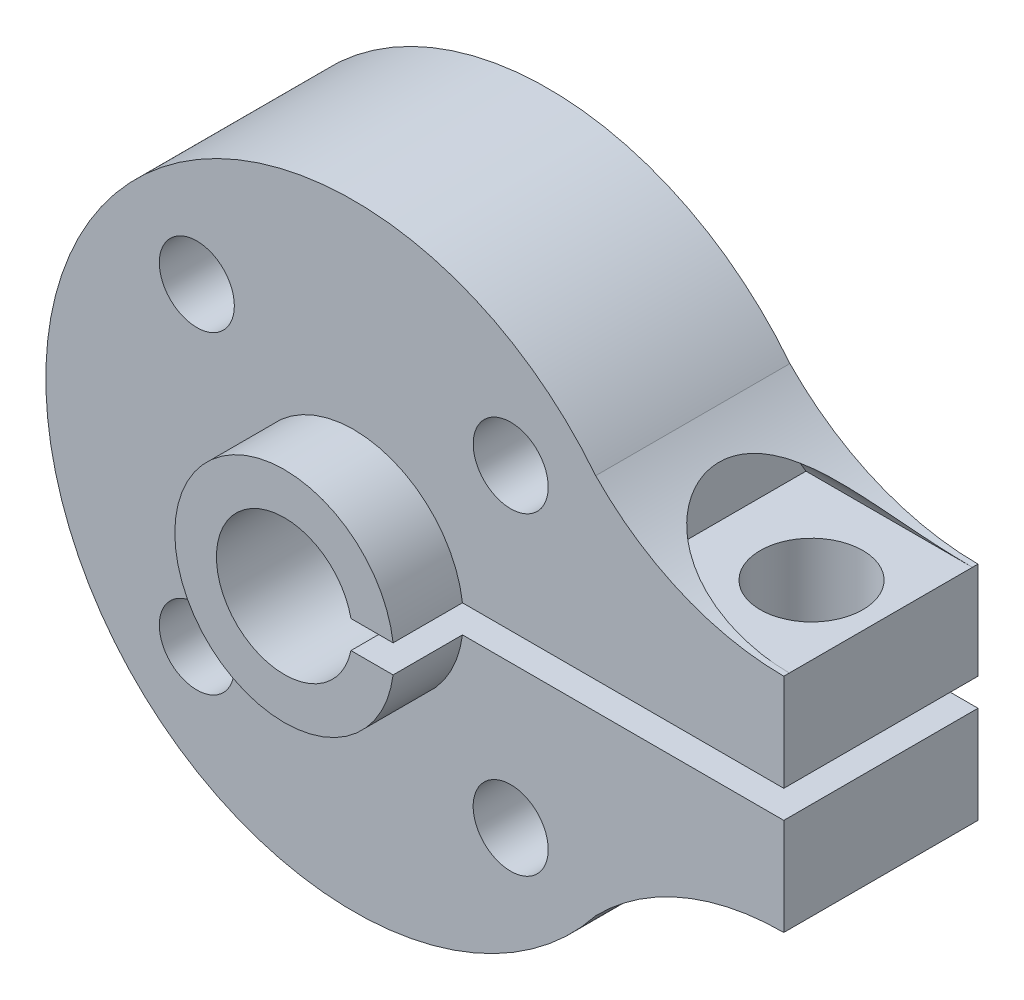
ISO-10303-21;
HEADER;
FILE_DESCRIPTION(('STEP AP214'),'2;1');
FILE_NAME('part.step','',(''),(''),'','','');
FILE_SCHEMA(('AUTOMOTIVE_DESIGN { 1 0 10303 214 1 1 1 1 }'));
ENDSEC;
DATA;
#1=APPLICATION_CONTEXT('core data for automotive mechanical design processes');
#2=APPLICATION_PROTOCOL_DEFINITION('international standard','automotive_design',2000,#1);
#3=PRODUCT_CONTEXT('',#1,'mechanical');
#4=PRODUCT('Part','Part','',(#3));
#5=PRODUCT_RELATED_PRODUCT_CATEGORY('part','',(#4));
#6=PRODUCT_DEFINITION_FORMATION('','',#4);
#7=PRODUCT_DEFINITION_CONTEXT('part definition',#1,'design');
#8=PRODUCT_DEFINITION('design','',#6,#7);
#9=PRODUCT_DEFINITION_SHAPE('','',#8);
#10=(LENGTH_UNIT() NAMED_UNIT(*) SI_UNIT(.MILLI.,.METRE.));
#11=(NAMED_UNIT(*) PLANE_ANGLE_UNIT() SI_UNIT($,.RADIAN.));
#12=(NAMED_UNIT(*) SI_UNIT($,.STERADIAN.) SOLID_ANGLE_UNIT());
#13=UNCERTAINTY_MEASURE_WITH_UNIT(LENGTH_MEASURE(1.E-05),#10,'distance_accuracy_value','');
#14=(GEOMETRIC_REPRESENTATION_CONTEXT(3) GLOBAL_UNCERTAINTY_ASSIGNED_CONTEXT((#13)) GLOBAL_UNIT_ASSIGNED_CONTEXT((#10,
#11,#12)) REPRESENTATION_CONTEXT('',''));
#15=CARTESIAN_POINT('',(0.,0.,0.));
#16=DIRECTION('',(0.,0.,1.));
#17=DIRECTION('',(1.,0.,0.));
#18=AXIS2_PLACEMENT_3D('',#15,#16,#17);
#19=CARTESIAN_POINT('',(9.5,2.30819429931814,-3.5));
#20=DIRECTION('',(-1.,0.,0.));
#21=DIRECTION('',(0.,0.,1.));
#22=AXIS2_PLACEMENT_3D('',#19,#20,#21);
#23=PLANE('',#22);
#24=DIRECTION('',(0.,0.,-1.));
#25=VECTOR('',#24,1.);
#26=CARTESIAN_POINT('',(9.5,4.,-0.2));
#27=LINE('',#26,#25);
#28=CARTESIAN_POINT('',(9.5,4.,-0.199999999999997));
#29=VERTEX_POINT('',#28);
#30=CARTESIAN_POINT('',(9.5,4.,-6.8));
#31=VERTEX_POINT('',#30);
#32=EDGE_CURVE('E128',#29,#31,#27,.T.);
#33=ORIENTED_EDGE('',*,*,#32,.T.);
#34=CARTESIAN_POINT('',(9.5,2.30819429931814,-3.5));
#35=DIRECTION('',(1.,0.,0.));
#36=DIRECTION('',(0.,0.,-1.));
#37=AXIS2_PLACEMENT_3D('',#34,#35,#36);
#38=CIRCLE('',#37,3.70839675990308);
#39=EDGE_CURVE('E275',#31,#29,#38,.T.);
#40=ORIENTED_EDGE('',*,*,#39,.T.);
#41=EDGE_LOOP('',(#33,#40));
#42=FACE_BOUND('',#41,.T.);
#43=ADVANCED_FACE('F18',(#42),#23,.F.);
#44=CARTESIAN_POINT('',(9.5,4.,-0.2));
#45=DIRECTION('',(0.,-1.,0.));
#46=DIRECTION('',(0.,0.,-1.));
#47=AXIS2_PLACEMENT_3D('',#44,#45,#46);
#48=PLANE('',#47);
#49=CARTESIAN_POINT('',(13.,4.,-3.5));
#50=DIRECTION('',(0.,-1.,0.));
#51=DIRECTION('',(0.,0.,-1.));
#52=AXIS2_PLACEMENT_3D('',#49,#50,#51);
#53=CIRCLE('',#52,1.85);
#54=CARTESIAN_POINT('',(13.,4.,-5.35));
#55=VERTEX_POINT('',#54);
#56=EDGE_CURVE('E21',#55,#55,#53,.T.);
#57=ORIENTED_EDGE('',*,*,#56,.T.);
#58=EDGE_LOOP('',(#57));
#59=FACE_BOUND('',#58,.T.);
#60=DIRECTION('',(1.,0.,0.));
#61=VECTOR('',#60,1.);
#62=CARTESIAN_POINT('',(9.5,4.,-6.8));
#63=LINE('',#62,#61);
#64=CARTESIAN_POINT('',(15.5,4.00000000000001,-6.8));
#65=VERTEX_POINT('',#64);
#66=EDGE_CURVE('E103',#65,#31,#63,.F.);
#67=ORIENTED_EDGE('',*,*,#66,.T.);
#68=ORIENTED_EDGE('',*,*,#32,.F.);
#69=DIRECTION('',(1.,0.,0.));
#70=VECTOR('',#69,1.);
#71=CARTESIAN_POINT('',(9.5,4.,-0.199999999999997));
#72=LINE('',#71,#70);
#73=CARTESIAN_POINT('',(15.5,4.00000000000001,-0.199999999999999));
#74=VERTEX_POINT('',#73);
#75=EDGE_CURVE('E122',#29,#74,#72,.T.);
#76=ORIENTED_EDGE('',*,*,#75,.T.);
#77=DIRECTION('',(0.,0.,-1.));
#78=VECTOR('',#77,1.);
#79=CARTESIAN_POINT('',(15.5,4.,-7.));
#80=LINE('',#79,#78);
#81=EDGE_CURVE('E119',#65,#74,#80,.F.);
#82=ORIENTED_EDGE('',*,*,#81,.F.);
#83=EDGE_LOOP('',(#67,#68,#76,#82));
#84=FACE_BOUND('',#83,.T.);
#85=ADVANCED_FACE('F195',(#59,#84),#48,.F.);
#86=CARTESIAN_POINT('',(0.,0.,2.5));
#87=DIRECTION('',(0.,0.,1.));
#88=DIRECTION('',(1.,0.,0.));
#89=AXIS2_PLACEMENT_3D('',#86,#87,#88);
#90=PLANE('',#89);
#91=CARTESIAN_POINT('',(0.,0.,2.5));
#92=DIRECTION('',(0.,0.,-1.));
#93=DIRECTION('',(-1.,0.,0.));
#94=AXIS2_PLACEMENT_3D('',#91,#92,#93);
#95=CIRCLE('',#94,3.95);
#96=CARTESIAN_POINT('',(3.91822663969301,-0.5,2.5));
#97=VERTEX_POINT('',#96);
#98=CARTESIAN_POINT('',(3.91822663969301,0.5,2.5));
#99=VERTEX_POINT('',#98);
#100=EDGE_CURVE('E93',#97,#99,#95,.T.);
#101=ORIENTED_EDGE('',*,*,#100,.F.);
#102=DIRECTION('',(1.,0.,0.));
#103=VECTOR('',#102,1.);
#104=CARTESIAN_POINT('',(0.,-0.5,2.5));
#105=LINE('',#104,#103);
#106=CARTESIAN_POINT('',(2.39843699104229,-0.500000000000001,2.5));
#107=VERTEX_POINT('',#106);
#108=EDGE_CURVE('E98',#107,#97,#105,.T.);
#109=ORIENTED_EDGE('',*,*,#108,.F.);
#110=CARTESIAN_POINT('',(0.,0.,2.5));
#111=DIRECTION('',(0.,0.,1.));
#112=DIRECTION('',(1.,0.,0.));
#113=AXIS2_PLACEMENT_3D('',#110,#111,#112);
#114=CIRCLE('',#113,2.45);
#115=CARTESIAN_POINT('',(2.39843699104229,0.5,2.5));
#116=VERTEX_POINT('',#115);
#117=EDGE_CURVE('E112',#107,#116,#114,.F.);
#118=ORIENTED_EDGE('',*,*,#117,.T.);
#119=DIRECTION('',(1.,0.,0.));
#120=VECTOR('',#119,1.);
#121=CARTESIAN_POINT('',(0.,0.5,2.5));
#122=LINE('',#121,#120);
#123=EDGE_CURVE('E100',#116,#99,#122,.T.);
#124=ORIENTED_EDGE('',*,*,#123,.T.);
#125=EDGE_LOOP('',(#101,#109,#118,#124));
#126=FACE_BOUND('',#125,.T.);
#127=ADVANCED_FACE('F95',(#126),#90,.T.);
#128=CARTESIAN_POINT('',(13.,11.1,-3.5));
#129=DIRECTION('',(0.,-1.,0.));
#130=DIRECTION('',(0.,0.,-1.));
#131=AXIS2_PLACEMENT_3D('',#128,#129,#130);
#132=CYLINDRICAL_SURFACE('',#131,1.85);
#133=CARTESIAN_POINT('',(13.,0.5,-3.5));
#134=DIRECTION('',(0.,-1.,0.));
#135=DIRECTION('',(0.,0.,-1.));
#136=AXIS2_PLACEMENT_3D('',#133,#134,#135);
#137=CIRCLE('',#136,1.85);
#138=CARTESIAN_POINT('',(13.,0.5,-5.35));
#139=VERTEX_POINT('',#138);
#140=EDGE_CURVE('E271',#139,#139,#137,.F.);
#141=ORIENTED_EDGE('',*,*,#140,.F.);
#142=EDGE_LOOP('',(#141));
#143=FACE_BOUND('',#142,.T.);
#144=ORIENTED_EDGE('',*,*,#56,.F.);
#145=EDGE_LOOP('',(#144));
#146=FACE_BOUND('',#145,.T.);
#147=ADVANCED_FACE('F190',(#143,#146),#132,.F.);
#148=CARTESIAN_POINT('',(0.,0.,2.5));
#149=DIRECTION('',(0.,0.,-1.));
#150=DIRECTION('',(-1.,0.,0.));
#151=AXIS2_PLACEMENT_3D('',#148,#149,#150);
#152=CYLINDRICAL_SURFACE('',#151,3.95);
#153=CARTESIAN_POINT('',(0.,0.,0.));
#154=DIRECTION('',(0.,0.,-1.));
#155=DIRECTION('',(-1.,0.,0.));
#156=AXIS2_PLACEMENT_3D('',#153,#154,#155);
#157=CIRCLE('',#156,3.95);
#158=CARTESIAN_POINT('',(3.91822663969301,-0.5,0.));
#159=VERTEX_POINT('',#158);
#160=CARTESIAN_POINT('',(3.91822663969301,0.5,0.));
#161=VERTEX_POINT('',#160);
#162=EDGE_CURVE('E108',#159,#161,#157,.T.);
#163=ORIENTED_EDGE('',*,*,#162,.F.);
#164=DIRECTION('',(0.,0.,1.));
#165=VECTOR('',#164,1.);
#166=CARTESIAN_POINT('',(3.91822663969301,-0.5,-7.));
#167=LINE('',#166,#165);
#168=EDGE_CURVE('E105',#97,#159,#167,.F.);
#169=ORIENTED_EDGE('',*,*,#168,.F.);
#170=ORIENTED_EDGE('',*,*,#100,.T.);
#171=DIRECTION('',(0.,0.,-1.));
#172=VECTOR('',#171,1.);
#173=CARTESIAN_POINT('',(3.91822663969301,0.5,-7.));
#174=LINE('',#173,#172);
#175=EDGE_CURVE('E126',#161,#99,#174,.F.);
#176=ORIENTED_EDGE('',*,*,#175,.F.);
#177=EDGE_LOOP('',(#163,#169,#170,#176));
#178=FACE_BOUND('',#177,.T.);
#179=ADVANCED_FACE('F106',(#178),#152,.T.);
#180=CARTESIAN_POINT('',(9.5,2.30819429931814,-3.5));
#181=DIRECTION('',(1.,0.,0.));
#182=DIRECTION('',(0.,0.,-1.));
#183=AXIS2_PLACEMENT_3D('',#180,#181,#182);
#184=CYLINDRICAL_SURFACE('',#183,3.70839675990308);
#185=ORIENTED_EDGE('',*,*,#75,.F.);
#186=ORIENTED_EDGE('',*,*,#39,.F.);
#187=ORIENTED_EDGE('',*,*,#66,.F.);
#188=CARTESIAN_POINT('',(15.5,4.00000000000001,-6.8));
#189=CARTESIAN_POINT('',(15.3854172561424,3.99999807144268,-6.79999040357477));
#190=CARTESIAN_POINT('',(15.2708345037204,4.00208452565124,-6.79893104370746));
#191=CARTESIAN_POINT('',(15.0418545088414,4.01042007363529,-6.79464326988381));
#192=CARTESIAN_POINT('',(14.927457277829,4.01666941510604,-6.79141472685915));
#193=CARTESIAN_POINT('',(14.6988557808845,4.03333058412203,-6.78271174393225));
#194=CARTESIAN_POINT('',(14.5846521614541,4.04374938302888,-6.7772335421817));
#195=CARTESIAN_POINT('',(14.3568466591295,4.06871528645662,-6.76388854983141));
#196=CARTESIAN_POINT('',(14.2432447653972,4.08326231636213,-6.75602180240309));
#197=CARTESIAN_POINT('',(13.9012476272513,4.13338726905937,-6.72837211210196));
#198=CARTESIAN_POINT('',(13.6740472792935,4.17527511633217,-6.70462249151998));
#199=CARTESIAN_POINT('',(13.2250868669362,4.27510326310531,-6.6443418692978));
#200=CARTESIAN_POINT('',(13.0033221022707,4.33302911979295,-6.60782235966463));
#201=CARTESIAN_POINT('',(12.6529356022981,4.43813091397702,-6.53609331014185));
#202=CARTESIAN_POINT('',(12.5218503492442,4.48063203510912,-6.50597227338733));
#203=CARTESIAN_POINT('',(12.2632290057728,4.57071030493076,-6.43877426680966));
#204=CARTESIAN_POINT('',(12.1356928962284,4.61828742625828,-6.40169733448122));
#205=CARTESIAN_POINT('',(11.8854487831583,4.71775519771825,-6.31963922664295));
#206=CARTESIAN_POINT('',(11.7627254940675,4.76963022726073,-6.27468606548902));
#207=CARTESIAN_POINT('',(11.5227135874723,4.87697578128224,-6.1756110759212));
#208=CARTESIAN_POINT('',(11.4054232772453,4.9324451727882,-6.12149212804412));
#209=CARTESIAN_POINT('',(11.1256985684173,5.071639846092,-5.97585734382104));
#210=CARTESIAN_POINT('',(10.9669053561282,5.15677415238714,-5.87851068639103));
#211=CARTESIAN_POINT('',(10.6682954041506,5.32718244619846,-5.65805983866076));
#212=CARTESIAN_POINT('',(10.5284532138079,5.41245608755684,-5.53499076935316));
#213=CARTESIAN_POINT('',(10.3029570714845,5.55700216381974,-5.29236628463612));
#214=CARTESIAN_POINT('',(10.2122236670459,5.61776209979495,-5.17843958840173));
#215=CARTESIAN_POINT('',(10.0487893069114,5.73065496290753,-4.93421505548655));
#216=CARTESIAN_POINT('',(9.9760826861075,5.78279059860417,-4.80392238142989));
#217=CARTESIAN_POINT('',(9.88271984953563,5.85123562170812,-4.59746178007879));
#218=CARTESIAN_POINT('',(9.85411340712692,5.87250463892868,-4.52642625450106));
#219=CARTESIAN_POINT('',(9.8026542883283,5.91113202664649,-4.38128999145579));
#220=CARTESIAN_POINT('',(9.77979860146108,5.92849244276425,-4.30719088150623));
#221=CARTESIAN_POINT('',(9.74015073098037,5.95881984828704,-4.15653545136116));
#222=CARTESIAN_POINT('',(9.72335620443467,5.97178853518842,-4.07998009311206));
#223=CARTESIAN_POINT('',(9.69604787686337,5.99297113329586,-3.92514115874213));
#224=CARTESIAN_POINT('',(9.68553304823361,6.00118582243504,-3.84685786755397));
#225=CARTESIAN_POINT('',(9.66571269419053,6.01668686364119,-3.63272797682053));
#226=CARTESIAN_POINT('',(9.66268060711464,6.01908388455584,-3.49585578487429));
#227=CARTESIAN_POINT('',(9.67580092483512,6.00879517138107,-3.22372435833211));
#228=CARTESIAN_POINT('',(9.69194697787807,5.99611443100813,-3.08846460468292));
#229=CARTESIAN_POINT('',(9.74140060570358,5.95784036040203,-2.83033541035476));
#230=CARTESIAN_POINT('',(9.77379479620415,5.93293564756356,-2.70718559216987));
#231=CARTESIAN_POINT('',(9.85403038461301,5.87246966733323,-2.46884489684084));
#232=CARTESIAN_POINT('',(9.90187372262157,5.83690706156605,-2.3536550215112));
#233=CARTESIAN_POINT('',(10.0153708669368,5.75467131035559,-2.12530832541396));
#234=CARTESIAN_POINT('',(10.0820564209863,5.70738398145104,-2.01289063057051));
#235=CARTESIAN_POINT('',(10.2292221810183,5.6064316192375,-1.80068540326612));
#236=CARTESIAN_POINT('',(10.3097094543092,5.5527633228289,-1.7009043872791));
#237=CARTESIAN_POINT('',(10.4617575283369,5.45514545743436,-1.53638994983406));
#238=CARTESIAN_POINT('',(10.5309064551307,5.41191057285586,-1.46895760039825));
#239=CARTESIAN_POINT('',(10.6750840937526,5.32452300554102,-1.34130785397804));
#240=CARTESIAN_POINT('',(10.7501152592551,5.28036994550685,-1.28109349462555));
#241=CARTESIAN_POINT('',(10.9053325302043,5.19204954805675,-1.16745307872577));
#242=CARTESIAN_POINT('',(10.9855265073713,5.14788229613573,-1.11403777634629));
#243=CARTESIAN_POINT('',(11.1502648300482,5.06037063385561,-1.01360351201137));
#244=CARTESIAN_POINT('',(11.2348105538086,5.01702649020899,-0.966586593895368));
#245=CARTESIAN_POINT('',(11.4491601443267,4.911317642686,-0.857234031716228));
#246=CARTESIAN_POINT('',(11.5811855099708,4.84982407399195,-0.798397249946977));
#247=CARTESIAN_POINT('',(11.8517008005558,4.73158833415568,-0.691850969184468));
#248=CARTESIAN_POINT('',(11.9901938582407,4.6748485035395,-0.644146931053226));
#249=CARTESIAN_POINT('',(12.2727994055429,4.56698866176262,-0.55809041968488));
#250=CARTESIAN_POINT('',(12.4169310013095,4.51589049754443,-0.519773645044782));
#251=CARTESIAN_POINT('',(12.7092115298442,4.4202921877755,-0.451279086548751));
#252=CARTESIAN_POINT('',(12.8573601583134,4.37579154409097,-0.421100688078474));
#253=CARTESIAN_POINT('',(13.2088503671494,4.27964035910126,-0.358348077632845));
#254=CARTESIAN_POINT('',(13.4134887431049,4.2308754157276,-0.328582781999699));
#255=CARTESIAN_POINT('',(13.8267983828837,4.14695137700669,-0.279202513194161));
#256=CARTESIAN_POINT('',(14.0354716910433,4.11179937907043,-0.259592833084839));
#257=CARTESIAN_POINT('',(14.4530137871775,4.05585754801038,-0.229084764078337));
#258=CARTESIAN_POINT('',(14.6618549020662,4.03491321046651,-0.218092452133776));
#259=CARTESIAN_POINT('',(14.9758505914231,4.0139678532927,-0.207190475715985));
#260=CARTESIAN_POINT('',(15.0805924216449,4.00873126349008,-0.20448752831259));
#261=CARTESIAN_POINT('',(15.2902194458754,4.00174728093229,-0.200895003143423));
#262=CARTESIAN_POINT('',(15.3951046341522,3.99999975253346,-0.200005354882309));
#263=CARTESIAN_POINT('',(15.5,4.00000000000001,-0.200000000000002));
#264=B_SPLINE_CURVE_WITH_KNOTS('',3,(#188,#189,#190,#191,#192,#193,#194,#195,#196,#197,#198,
#199,#200,#201,#202,#203,#204,#205,#206,#207,#208,#209,#210,#211,#212,#213,#214,#215,#216,#217,
#218,#219,#220,#221,#222,#223,#224,#225,#226,#227,#228,#229,#230,#231,#232,#233,#234,#235,#236,
#237,#238,#239,#240,#241,#242,#243,#244,#245,#246,#247,#248,#249,#250,#251,#252,#253,#254,#255,
#256,#257,#258,#259,#260,#261,#262,#263),.UNSPECIFIED.,.F.,.F.,(4,2,2,2,2,2,2,2,2,2,2,2,2,2,2,2,
2,2,2,2,2,2,2,2,2,2,2,2,2,2,2,2,2,2,2,2,2,4),(0.,0.343723971843537,0.687468397378402,
1.03178998346891,1.37610534654196,2.07189509147165,2.76706027899653,3.18996821448662,
3.61287387042043,4.03430477997363,4.45560349113384,5.06790502421624,5.67937592856169,
6.15105760704356,6.62259086613704,6.86072027072558,7.09872475577783,7.33663714177353,
7.57451058532365,7.9829511201066,8.391256418087,8.77882172170533,9.16643571462257,
9.58186622266927,9.99751009479543,10.3145531519377,10.6317291690792,10.9494007936139,
11.2671736551728,11.7376814003852,12.2084194574227,12.6809208132693,13.1533864755719,
13.7899635271709,14.4268720269306,15.0567382504914,15.3713976456646,15.6860448076409),.UNSPECIFIED.);
#265=EDGE_CURVE('E166',#65,#74,#264,.T.);
#266=ORIENTED_EDGE('',*,*,#265,.T.);
#267=EDGE_LOOP('',(#185,#186,#187,#266));
#268=FACE_BOUND('',#267,.T.);
#269=ADVANCED_FACE('F180',(#268),#184,.F.);
#270=CARTESIAN_POINT('',(15.5,0.5,-7.));
#271=DIRECTION('',(1.,0.,0.));
#272=DIRECTION('',(0.,0.,-1.));
#273=AXIS2_PLACEMENT_3D('',#270,#271,#272);
#274=PLANE('',#273);
#275=ORIENTED_EDGE('',*,*,#81,.T.);
#276=DIRECTION('',(0.,0.,1.));
#277=VECTOR('',#276,1.);
#278=CARTESIAN_POINT('',(15.5,4.00000000000001,-7.));
#279=LINE('',#278,#277);
#280=CARTESIAN_POINT('',(15.5,4.00000000000001,0.));
#281=VERTEX_POINT('',#280);
#282=EDGE_CURVE('E231',#74,#281,#279,.T.);
#283=ORIENTED_EDGE('',*,*,#282,.T.);
#284=DIRECTION('',(0.,1.,0.));
#285=VECTOR('',#284,1.);
#286=CARTESIAN_POINT('',(15.5,-13.4475790200994,0.));
#287=LINE('',#286,#285);
#288=CARTESIAN_POINT('',(15.5,0.5,0.));
#289=VERTEX_POINT('',#288);
#290=EDGE_CURVE('E242',#289,#281,#287,.T.);
#291=ORIENTED_EDGE('',*,*,#290,.F.);
#292=DIRECTION('',(0.,0.,-1.));
#293=VECTOR('',#292,1.);
#294=CARTESIAN_POINT('',(15.5,0.5,-7.));
#295=LINE('',#294,#293);
#296=CARTESIAN_POINT('',(15.5,0.5,-7.));
#297=VERTEX_POINT('',#296);
#298=EDGE_CURVE('E261',#297,#289,#295,.F.);
#299=ORIENTED_EDGE('',*,*,#298,.F.);
#300=DIRECTION('',(0.,1.,0.));
#301=VECTOR('',#300,1.);
#302=CARTESIAN_POINT('',(15.5,-13.4475790200994,-7.));
#303=LINE('',#302,#301);
#304=CARTESIAN_POINT('',(15.5,4.00000000000001,-7.));
#305=VERTEX_POINT('',#304);
#306=EDGE_CURVE('E174',#297,#305,#303,.T.);
#307=ORIENTED_EDGE('',*,*,#306,.T.);
#308=DIRECTION('',(0.,0.,1.));
#309=VECTOR('',#308,1.);
#310=CARTESIAN_POINT('',(15.5,4.00000000000001,-7.));
#311=LINE('',#310,#309);
#312=EDGE_CURVE('E175',#305,#65,#311,.T.);
#313=ORIENTED_EDGE('',*,*,#312,.T.);
#314=EDGE_LOOP('',(#275,#283,#291,#299,#307,#313));
#315=FACE_BOUND('',#314,.T.);
#316=ADVANCED_FACE('F185',(#315),#274,.T.);
#317=CARTESIAN_POINT('',(0.,-0.5,-7.));
#318=DIRECTION('',(0.,1.,0.));
#319=DIRECTION('',(0.,0.,1.));
#320=AXIS2_PLACEMENT_3D('',#317,#318,#319);
#321=PLANE('',#320);
#322=CARTESIAN_POINT('',(13.,-0.5,-3.5));
#323=DIRECTION('',(0.,1.,0.));
#324=DIRECTION('',(0.,0.,1.));
#325=AXIS2_PLACEMENT_3D('',#322,#323,#324);
#326=CIRCLE('',#325,1.35254999999999);
#327=CARTESIAN_POINT('',(13.,-0.5,-2.14745000000001));
#328=VERTEX_POINT('',#327);
#329=EDGE_CURVE('E270',#328,#328,#326,.F.);
#330=ORIENTED_EDGE('',*,*,#329,.T.);
#331=EDGE_LOOP('',(#330));
#332=FACE_BOUND('',#331,.T.);
#333=DIRECTION('',(0.,0.,-1.));
#334=VECTOR('',#333,1.);
#335=CARTESIAN_POINT('',(15.5,-0.5,-7.));
#336=LINE('',#335,#334);
#337=CARTESIAN_POINT('',(15.5,-0.5,-7.));
#338=VERTEX_POINT('',#337);
#339=CARTESIAN_POINT('',(15.5,-0.5,0.));
#340=VERTEX_POINT('',#339);
#341=EDGE_CURVE('E267',#338,#340,#336,.F.);
#342=ORIENTED_EDGE('',*,*,#341,.F.);
#343=DIRECTION('',(1.,0.,0.));
#344=VECTOR('',#343,1.);
#345=CARTESIAN_POINT('',(15.5,-0.5,-7.));
#346=LINE('',#345,#344);
#347=CARTESIAN_POINT('',(2.39843699104229,-0.500000000000001,-7.));
#348=VERTEX_POINT('',#347);
#349=EDGE_CURVE('E218',#338,#348,#346,.F.);
#350=ORIENTED_EDGE('',*,*,#349,.T.);
#351=DIRECTION('',(0.,0.,1.));
#352=VECTOR('',#351,1.);
#353=CARTESIAN_POINT('',(2.39843699104229,-0.500000000000002,-7.));
#354=LINE('',#353,#352);
#355=EDGE_CURVE('E117',#348,#107,#354,.T.);
#356=ORIENTED_EDGE('',*,*,#355,.T.);
#357=ORIENTED_EDGE('',*,*,#108,.T.);
#358=ORIENTED_EDGE('',*,*,#168,.T.);
#359=DIRECTION('',(1.,0.,0.));
#360=VECTOR('',#359,1.);
#361=CARTESIAN_POINT('',(15.5,-0.5,0.));
#362=LINE('',#361,#360);
#363=EDGE_CURVE('E234',#340,#159,#362,.F.);
#364=ORIENTED_EDGE('',*,*,#363,.F.);
#365=EDGE_LOOP('',(#342,#350,#356,#357,#358,#364));
#366=FACE_BOUND('',#365,.T.);
#367=ADVANCED_FACE('F115',(#332,#366),#321,.T.);
#368=CARTESIAN_POINT('',(0.,0.,-7.));
#369=DIRECTION('',(0.,0.,1.));
#370=DIRECTION('',(1.,0.,0.));
#371=AXIS2_PLACEMENT_3D('',#368,#369,#370);
#372=CYLINDRICAL_SURFACE('',#371,2.45);
#373=CARTESIAN_POINT('',(0.,0.,-7.));
#374=DIRECTION('',(0.,0.,1.));
#375=DIRECTION('',(1.,0.,0.));
#376=AXIS2_PLACEMENT_3D('',#373,#374,#375);
#377=CIRCLE('',#376,2.45);
#378=CARTESIAN_POINT('',(2.39843699104229,0.5,-7.));
#379=VERTEX_POINT('',#378);
#380=EDGE_CURVE('E319',#348,#379,#377,.F.);
#381=ORIENTED_EDGE('',*,*,#380,.T.);
#382=DIRECTION('',(0.,0.,-1.));
#383=VECTOR('',#382,1.);
#384=CARTESIAN_POINT('',(2.39843699104229,0.5,-7.));
#385=LINE('',#384,#383);
#386=EDGE_CURVE('E258',#116,#379,#385,.T.);
#387=ORIENTED_EDGE('',*,*,#386,.F.);
#388=ORIENTED_EDGE('',*,*,#117,.F.);
#389=ORIENTED_EDGE('',*,*,#355,.F.);
#390=EDGE_LOOP('',(#381,#387,#388,#389));
#391=FACE_BOUND('',#390,.T.);
#392=ADVANCED_FACE('F330',(#391),#372,.F.);
#393=CARTESIAN_POINT('',(0.,0.5,-7.));
#394=DIRECTION('',(0.,-1.,0.));
#395=DIRECTION('',(0.,0.,-1.));
#396=AXIS2_PLACEMENT_3D('',#393,#394,#395);
#397=PLANE('',#396);
#398=ORIENTED_EDGE('',*,*,#140,.T.);
#399=EDGE_LOOP('',(#398));
#400=FACE_BOUND('',#399,.T.);
#401=ORIENTED_EDGE('',*,*,#175,.T.);
#402=ORIENTED_EDGE('',*,*,#123,.F.);
#403=ORIENTED_EDGE('',*,*,#386,.T.);
#404=DIRECTION('',(1.,0.,0.));
#405=VECTOR('',#404,1.);
#406=CARTESIAN_POINT('',(15.5,0.5,-7.));
#407=LINE('',#406,#405);
#408=EDGE_CURVE('E318',#379,#297,#407,.T.);
#409=ORIENTED_EDGE('',*,*,#408,.T.);
#410=ORIENTED_EDGE('',*,*,#298,.T.);
#411=DIRECTION('',(1.,0.,0.));
#412=VECTOR('',#411,1.);
#413=CARTESIAN_POINT('',(15.5,0.5,0.));
#414=LINE('',#413,#412);
#415=EDGE_CURVE('E247',#161,#289,#414,.T.);
#416=ORIENTED_EDGE('',*,*,#415,.F.);
#417=EDGE_LOOP('',(#401,#402,#403,#409,#410,#416));
#418=FACE_BOUND('',#417,.T.);
#419=ADVANCED_FACE('F332',(#400,#418),#397,.T.);
#420=CARTESIAN_POINT('',(-5.65651622481619,5.65719225397115,0.));
#421=DIRECTION('',(0.,0.,1.));
#422=DIRECTION('',(1.,0.,0.));
#423=AXIS2_PLACEMENT_3D('',#420,#421,#422);
#424=CYLINDRICAL_SURFACE('',#423,1.35254999999999);
#425=CARTESIAN_POINT('',(-5.65651622481619,5.65719225397115,0.));
#426=DIRECTION('',(0.,0.,1.));
#427=DIRECTION('',(1.,0.,0.));
#428=AXIS2_PLACEMENT_3D('',#425,#426,#427);
#429=CIRCLE('',#428,1.35254999999999);
#430=CARTESIAN_POINT('',(-4.3039662248162,5.65719225397115,0.));
#431=VERTEX_POINT('',#430);
#432=EDGE_CURVE('E236',#431,#431,#429,.F.);
#433=ORIENTED_EDGE('',*,*,#432,.F.);
#434=EDGE_LOOP('',(#433));
#435=FACE_BOUND('',#434,.T.);
#436=CARTESIAN_POINT('',(-5.65651622481619,5.65719225397115,-7.));
#437=DIRECTION('',(0.,0.,1.));
#438=DIRECTION('',(1.,0.,0.));
#439=AXIS2_PLACEMENT_3D('',#436,#437,#438);
#440=CIRCLE('',#439,1.35254999999999);
#441=CARTESIAN_POINT('',(-4.3039662248162,5.65719225397115,-7.));
#442=VERTEX_POINT('',#441);
#443=EDGE_CURVE('E316',#442,#442,#440,.F.);
#444=ORIENTED_EDGE('',*,*,#443,.T.);
#445=EDGE_LOOP('',(#444));
#446=FACE_BOUND('',#445,.T.);
#447=ADVANCED_FACE('F364',(#435,#446),#424,.F.);
#448=CARTESIAN_POINT('',(5.65719225397115,5.65651622481619,0.));
#449=DIRECTION('',(0.,0.,1.));
#450=DIRECTION('',(1.,0.,0.));
#451=AXIS2_PLACEMENT_3D('',#448,#449,#450);
#452=CYLINDRICAL_SURFACE('',#451,1.35254999999999);
#453=CARTESIAN_POINT('',(5.65719225397115,5.65651622481619,0.));
#454=DIRECTION('',(0.,0.,1.));
#455=DIRECTION('',(1.,0.,0.));
#456=AXIS2_PLACEMENT_3D('',#453,#454,#455);
#457=CIRCLE('',#456,1.35254999999999);
#458=CARTESIAN_POINT('',(7.00974225397114,5.65651622481619,0.));
#459=VERTEX_POINT('',#458);
#460=EDGE_CURVE('E290',#459,#459,#457,.F.);
#461=ORIENTED_EDGE('',*,*,#460,.F.);
#462=EDGE_LOOP('',(#461));
#463=FACE_BOUND('',#462,.T.);
#464=CARTESIAN_POINT('',(5.65719225397115,5.65651622481619,-7.));
#465=DIRECTION('',(0.,0.,1.));
#466=DIRECTION('',(1.,0.,0.));
#467=AXIS2_PLACEMENT_3D('',#464,#465,#466);
#468=CIRCLE('',#467,1.35254999999999);
#469=CARTESIAN_POINT('',(7.00974225397114,5.65651622481619,-7.));
#470=VERTEX_POINT('',#469);
#471=EDGE_CURVE('E311',#470,#470,#468,.F.);
#472=ORIENTED_EDGE('',*,*,#471,.T.);
#473=EDGE_LOOP('',(#472));
#474=FACE_BOUND('',#473,.T.);
#475=ADVANCED_FACE('F368',(#463,#474),#452,.F.);
#476=CARTESIAN_POINT('',(5.65651622481619,-5.65719225397115,0.));
#477=DIRECTION('',(0.,0.,1.));
#478=DIRECTION('',(1.,0.,0.));
#479=AXIS2_PLACEMENT_3D('',#476,#477,#478);
#480=CYLINDRICAL_SURFACE('',#479,1.35254999999999);
#481=CARTESIAN_POINT('',(5.65651622481619,-5.65719225397115,0.));
#482=DIRECTION('',(0.,0.,1.));
#483=DIRECTION('',(1.,0.,0.));
#484=AXIS2_PLACEMENT_3D('',#481,#482,#483);
#485=CIRCLE('',#484,1.35254999999999);
#486=CARTESIAN_POINT('',(7.00906622481618,-5.65719225397115,0.));
#487=VERTEX_POINT('',#486);
#488=EDGE_CURVE('E293',#487,#487,#485,.F.);
#489=ORIENTED_EDGE('',*,*,#488,.F.);
#490=EDGE_LOOP('',(#489));
#491=FACE_BOUND('',#490,.T.);
#492=CARTESIAN_POINT('',(5.65651622481619,-5.65719225397115,-7.));
#493=DIRECTION('',(0.,0.,1.));
#494=DIRECTION('',(1.,0.,0.));
#495=AXIS2_PLACEMENT_3D('',#492,#493,#494);
#496=CIRCLE('',#495,1.35254999999999);
#497=CARTESIAN_POINT('',(7.00906622481618,-5.65719225397115,-7.));
#498=VERTEX_POINT('',#497);
#499=EDGE_CURVE('E308',#498,#498,#496,.F.);
#500=ORIENTED_EDGE('',*,*,#499,.T.);
#501=EDGE_LOOP('',(#500));
#502=FACE_BOUND('',#501,.T.);
#503=ADVANCED_FACE('F304',(#491,#502),#480,.F.);
#504=CARTESIAN_POINT('',(-5.65719225397115,-5.65651622481619,0.));
#505=DIRECTION('',(0.,0.,1.));
#506=DIRECTION('',(1.,0.,0.));
#507=AXIS2_PLACEMENT_3D('',#504,#505,#506);
#508=CYLINDRICAL_SURFACE('',#507,1.35254999999999);
#509=CARTESIAN_POINT('',(-5.65719225397115,-5.65651622481619,0.));
#510=DIRECTION('',(0.,0.,1.));
#511=DIRECTION('',(1.,0.,0.));
#512=AXIS2_PLACEMENT_3D('',#509,#510,#511);
#513=CIRCLE('',#512,1.35254999999999);
#514=CARTESIAN_POINT('',(-4.30464225397116,-5.65651622481619,0.));
#515=VERTEX_POINT('',#514);
#516=EDGE_CURVE('E233',#515,#515,#513,.F.);
#517=ORIENTED_EDGE('',*,*,#516,.F.);
#518=EDGE_LOOP('',(#517));
#519=FACE_BOUND('',#518,.T.);
#520=CARTESIAN_POINT('',(-5.65719225397115,-5.65651622481619,-7.));
#521=DIRECTION('',(0.,0.,1.));
#522=DIRECTION('',(1.,0.,0.));
#523=AXIS2_PLACEMENT_3D('',#520,#521,#522);
#524=CIRCLE('',#523,1.35254999999999);
#525=CARTESIAN_POINT('',(-4.30464225397116,-5.65651622481619,-7.));
#526=VERTEX_POINT('',#525);
#527=EDGE_CURVE('E257',#526,#526,#524,.F.);
#528=ORIENTED_EDGE('',*,*,#527,.T.);
#529=EDGE_LOOP('',(#528));
#530=FACE_BOUND('',#529,.T.);
#531=ADVANCED_FACE('F300',(#519,#530),#508,.F.);
#532=CARTESIAN_POINT('',(15.5,-0.5,-7.));
#533=DIRECTION('',(1.,0.,0.));
#534=DIRECTION('',(0.,0.,-1.));
#535=AXIS2_PLACEMENT_3D('',#532,#533,#534);
#536=PLANE('',#535);
#537=DIRECTION('',(0.,1.,0.));
#538=VECTOR('',#537,1.);
#539=CARTESIAN_POINT('',(15.5,-13.4475790200994,-7.));
#540=LINE('',#539,#538);
#541=CARTESIAN_POINT('',(15.5,-4.00000000000001,-7.));
#542=VERTEX_POINT('',#541);
#543=EDGE_CURVE('E216',#542,#338,#540,.T.);
#544=ORIENTED_EDGE('',*,*,#543,.T.);
#545=ORIENTED_EDGE('',*,*,#341,.T.);
#546=DIRECTION('',(0.,1.,0.));
#547=VECTOR('',#546,1.);
#548=CARTESIAN_POINT('',(15.5,-13.4475790200994,0.));
#549=LINE('',#548,#547);
#550=CARTESIAN_POINT('',(15.5,-4.00000000000001,0.));
#551=VERTEX_POINT('',#550);
#552=EDGE_CURVE('E237',#551,#340,#549,.T.);
#553=ORIENTED_EDGE('',*,*,#552,.F.);
#554=DIRECTION('',(0.,0.,1.));
#555=VECTOR('',#554,1.);
#556=CARTESIAN_POINT('',(15.5,-4.00000000000001,-7.));
#557=LINE('',#556,#555);
#558=EDGE_CURVE('E254',#551,#542,#557,.F.);
#559=ORIENTED_EDGE('',*,*,#558,.T.);
#560=EDGE_LOOP('',(#544,#545,#553,#559));
#561=FACE_BOUND('',#560,.T.);
#562=ADVANCED_FACE('F303',(#561),#536,.T.);
#563=CARTESIAN_POINT('',(13.,-0.5,-3.5));
#564=DIRECTION('',(0.,1.,0.));
#565=DIRECTION('',(0.,0.,1.));
#566=AXIS2_PLACEMENT_3D('',#563,#564,#565);
#567=CYLINDRICAL_SURFACE('',#566,1.35254999999999);
#568=ORIENTED_EDGE('',*,*,#329,.F.);
#569=EDGE_LOOP('',(#568));
#570=FACE_BOUND('',#569,.T.);
#571=CARTESIAN_POINT('',(13.,-4.3367750302738,-2.14745000000001));
#572=CARTESIAN_POINT('',(12.9204851487771,-4.35859541499666,-2.14745327893679));
#573=CARTESIAN_POINT('',(12.8411573985793,-4.38149358243875,-2.1544873089395));
#574=CARTESIAN_POINT('',(12.6852233828783,-4.42868477443357,-2.18219691227584));
#575=CARTESIAN_POINT('',(12.6086238047205,-4.45298088948824,-2.20290386048637));
#576=CARTESIAN_POINT('',(12.4604238136452,-4.50197644860192,-2.25723517881549));
#577=CARTESIAN_POINT('',(12.3888159156169,-4.52667521711849,-2.2908396940311));
#578=CARTESIAN_POINT('',(12.2523975563339,-4.57542712001506,-2.37008673277669));
#579=CARTESIAN_POINT('',(12.1875844716815,-4.59948050088294,-2.41572458627591));
#580=CARTESIAN_POINT('',(12.066092706108,-4.64591476415354,-2.5183802283936));
#581=CARTESIAN_POINT('',(12.009475929731,-4.66828236277704,-2.57547755939347));
#582=CARTESIAN_POINT('',(11.9067943489346,-4.70980484353353,-2.69951911881265));
#583=CARTESIAN_POINT('',(11.8607277374493,-4.72896027570589,-2.76646165768281));
#584=CARTESIAN_POINT('',(11.7828595230148,-4.76188242697212,-2.9050429611292));
#585=CARTESIAN_POINT('',(11.750484358307,-4.77586185860484,-2.97630771465424));
#586=CARTESIAN_POINT('',(11.6983800807687,-4.79857595621328,-3.1240960569208));
#587=CARTESIAN_POINT('',(11.6786422846566,-4.80731422319208,-3.20061599464913));
#588=CARTESIAN_POINT('',(11.6538330569858,-4.81833124512195,-3.35003064716998));
#589=CARTESIAN_POINT('',(11.6477021624014,-4.82107632293047,-3.42271620206813));
#590=CARTESIAN_POINT('',(11.6472133398873,-4.82129439766837,-3.56812561197517));
#591=CARTESIAN_POINT('',(11.6528522686444,-4.81876880221257,-3.64084945157383));
#592=CARTESIAN_POINT('',(11.6751488910641,-4.80886387933527,-3.78104776644718));
#593=CARTESIAN_POINT('',(11.6913298512417,-4.80169462626299,-3.84861412241824));
#594=CARTESIAN_POINT('',(11.7335930127346,-4.78320045366594,-3.97996523649169));
#595=CARTESIAN_POINT('',(11.759676513263,-4.77187498885274,-4.04374949711308));
#596=CARTESIAN_POINT('',(11.8218442232517,-4.74533254981108,-4.16807937030676));
#597=CARTESIAN_POINT('',(11.858229553766,-4.72999967809934,-4.22844909361418));
#598=CARTESIAN_POINT('',(11.9394434654755,-4.69651550044697,-4.34232201689261));
#599=CARTESIAN_POINT('',(11.9842740193636,-4.67836353617776,-4.3958236076388));
#600=CARTESIAN_POINT('',(12.0848855503532,-4.63866994229758,-4.49876050491149));
#601=CARTESIAN_POINT('',(12.141240369494,-4.61697546004348,-4.5475761198635));
#602=CARTESIAN_POINT('',(12.2609023319215,-4.57238476046211,-4.63517857764382));
#603=CARTESIAN_POINT('',(12.32421517611,-4.54948756585884,-4.67395710821763));
#604=CARTESIAN_POINT('',(12.4604063804737,-4.50201369956741,-4.742743758772));
#605=CARTESIAN_POINT('',(12.5336359351567,-4.47742199081222,-4.7720466671701));
#606=CARTESIAN_POINT('',(12.6841928072668,-4.42903145395726,-4.81750429880625));
#607=CARTESIAN_POINT('',(12.7615110459203,-4.40523104573619,-4.83368694878717));
#608=CARTESIAN_POINT('',(12.8663091631003,-4.37447621185726,-4.84619256481914));
#609=CARTESIAN_POINT('',(12.8929448670468,-4.36678698824124,-4.84857208497996));
#610=CARTESIAN_POINT('',(12.9463720796099,-4.35161810246074,-4.85175140794023));
#611=CARTESIAN_POINT('',(12.973163601156,-4.3441384579949,-4.85255107771762));
#612=CARTESIAN_POINT('',(13.0756244028838,-4.31602504709524,-4.85254696301458));
#613=CARTESIAN_POINT('',(13.1516051765923,-4.29619794160847,-4.84618518657547));
#614=CARTESIAN_POINT('',(13.3020765407953,-4.25889500859745,-4.82059919768668));
#615=CARTESIAN_POINT('',(13.3765641738948,-4.24142351727095,-4.80135164331774));
#616=CARTESIAN_POINT('',(13.5217637685789,-4.20913412886104,-4.75023079003071));
#617=CARTESIAN_POINT('',(13.5924733817324,-4.19431786911498,-4.71834973936002));
#618=CARTESIAN_POINT('',(13.7277596656429,-4.16745643974485,-4.64269890734088));
#619=CARTESIAN_POINT('',(13.7923392997966,-4.15540992710321,-4.59893491043957));
#620=CARTESIAN_POINT('',(13.9118574259715,-4.13424678145696,-4.50184656621174));
#621=CARTESIAN_POINT('',(13.9669860117244,-4.12506823827677,-4.44876963540918));
#622=CARTESIAN_POINT('',(14.0676498921143,-4.10907125650647,-4.33387523915694));
#623=CARTESIAN_POINT('',(14.1131851956245,-4.10225281573339,-4.27205778179183));
#624=CARTESIAN_POINT('',(14.1926395751803,-4.09080862149923,-4.14241714608314));
#625=CARTESIAN_POINT('',(14.2267166066267,-4.08615268320467,-4.07469336223897));
#626=CARTESIAN_POINT('',(14.2831141086079,-4.07865420429124,-3.93442297936375));
#627=CARTESIAN_POINT('',(14.3054349430252,-4.07581160754451,-3.86187652968406));
#628=CARTESIAN_POINT('',(14.3376050448136,-4.07176693950704,-3.71423602346032));
#629=CARTESIAN_POINT('',(14.3474884948816,-4.0705603710723,-3.63914953451878));
#630=CARTESIAN_POINT('',(14.3546041554255,-4.06968846686252,-3.48837034297547));
#631=CARTESIAN_POINT('',(14.3518363622055,-4.07002313153773,-3.4126776401966));
#632=CARTESIAN_POINT('',(14.3337300101086,-4.07225794680073,-3.2628238698283));
#633=CARTESIAN_POINT('',(14.3183897145974,-4.07415831365847,-3.18866301528333));
#634=CARTESIAN_POINT('',(14.275592583415,-4.07965302497062,-3.04398970505836));
#635=CARTESIAN_POINT('',(14.2481357416078,-4.08324737028287,-2.97347725122596));
#636=CARTESIAN_POINT('',(14.1819346991144,-4.09233643795687,-2.83811050411693));
#637=CARTESIAN_POINT('',(14.143191881575,-4.09783092746287,-2.77325551875707));
#638=CARTESIAN_POINT('',(14.055599848678,-4.11096230824968,-2.6510284734972));
#639=CARTESIAN_POINT('',(14.0067515991758,-4.11859899480871,-2.59365569931734));
#640=CARTESIAN_POINT('',(13.9004049995365,-4.13624474947463,-2.48792835988961));
#641=CARTESIAN_POINT('',(13.8429000084126,-4.14625564236739,-2.43958078263145));
#642=CARTESIAN_POINT('',(13.721005850003,-4.16879867343352,-2.35321182421282));
#643=CARTESIAN_POINT('',(13.6566138825357,-4.18133183897985,-2.31519466572012));
#644=CARTESIAN_POINT('',(13.5222945181374,-4.20906311856515,-2.25010996413787));
#645=CARTESIAN_POINT('',(13.4523209297325,-4.22428509040085,-2.22314829723931));
#646=CARTESIAN_POINT('',(13.3095095255519,-4.25715750890202,-2.18124379642085));
#647=CARTESIAN_POINT('',(13.2366767221063,-4.27480383041943,-2.1662808356639));
#648=CARTESIAN_POINT('',(13.1362754772266,-4.30042912848766,-2.15405282071968));
#649=CARTESIAN_POINT('',(13.1090319345304,-4.30751251766951,-2.15157527392268));
#650=CARTESIAN_POINT('',(13.0545182692149,-4.32194677508648,-2.148273370897));
#651=CARTESIAN_POINT('',(13.02724814901,-4.32929762089378,-2.14744887637396));
#652=CARTESIAN_POINT('',(13.,-4.3367750302738,-2.14745000000001));
#653=B_SPLINE_CURVE_WITH_KNOTS('',3,(#571,#572,#573,#574,#575,#576,#577,#578,#579,#580,#581,
#582,#583,#584,#585,#586,#587,#588,#589,#590,#591,#592,#593,#594,#595,#596,#597,#598,#599,#600,
#601,#602,#603,#604,#605,#606,#607,#608,#609,#610,#611,#612,#613,#614,#615,#616,#617,#618,#619,
#620,#621,#622,#623,#624,#625,#626,#627,#628,#629,#630,#631,#632,#633,#634,#635,#636,#637,#638,
#639,#640,#641,#642,#643,#644,#645,#646,#647,#648,#649,#650,#651,#652),.UNSPECIFIED.,.T.,.F.,(4,
2,2,2,2,2,2,2,2,2,2,2,2,2,2,2,2,2,2,2,2,2,2,2,2,2,2,2,2,2,2,2,2,2,2,2,2,2,2,2,4),(0.,
0.247255462282673,0.495080275948558,0.742525101016616,0.989874035951996,1.23900325382083,
1.488089768075,1.72534689838326,1.96244083113818,2.18030974452767,2.39812048010031,
2.6067074000177,2.81532169599935,3.03080773271423,3.24634416668245,3.47829013190235,
3.71042757396997,3.95716865494211,4.20338315331434,4.28682463557653,4.37027314324104,
4.60542926833624,4.84101252332379,5.07674055358084,5.31235403991324,5.54245942976341,
5.77256460677845,5.99935350184505,6.22613537683831,6.45229259732355,6.6784498838793,
6.90463841471058,7.13082706008628,7.35698799668372,7.58312732728427,7.8094410323143,
8.03584710677597,8.26437345112515,8.49251565483498,8.57725224536552,8.66198174653673),.UNSPECIFIED.);
#654=CARTESIAN_POINT('',(13.,-4.3367750302738,-2.14745000000001));
#655=VERTEX_POINT('',#654);
#656=EDGE_CURVE('E136',#655,#655,#653,.T.);
#657=ORIENTED_EDGE('',*,*,#656,.T.);
#658=EDGE_LOOP('',(#657));
#659=FACE_BOUND('',#658,.T.);
#660=ADVANCED_FACE('F145',(#570,#659),#567,.F.);
#661=CARTESIAN_POINT('',(15.5,-13.4475790200994,0.));
#662=DIRECTION('',(0.,0.,1.));
#663=DIRECTION('',(1.,0.,0.));
#664=AXIS2_PLACEMENT_3D('',#661,#662,#663);
#665=PLANE('',#664);
#666=ORIENTED_EDGE('',*,*,#516,.T.);
#667=EDGE_LOOP('',(#666));
#668=FACE_BOUND('',#667,.T.);
#669=ORIENTED_EDGE('',*,*,#488,.T.);
#670=EDGE_LOOP('',(#669));
#671=FACE_BOUND('',#670,.T.);
#672=ORIENTED_EDGE('',*,*,#460,.T.);
#673=EDGE_LOOP('',(#672));
#674=FACE_BOUND('',#673,.T.);
#675=ORIENTED_EDGE('',*,*,#432,.T.);
#676=EDGE_LOOP('',(#675));
#677=FACE_BOUND('',#676,.T.);
#678=ORIENTED_EDGE('',*,*,#552,.T.);
#679=ORIENTED_EDGE('',*,*,#363,.T.);
#680=ORIENTED_EDGE('',*,*,#162,.T.);
#681=ORIENTED_EDGE('',*,*,#415,.T.);
#682=ORIENTED_EDGE('',*,*,#290,.T.);
#683=CARTESIAN_POINT('',(15.5,13.4475790200994,0.));
#684=DIRECTION('',(0.,0.,1.));
#685=DIRECTION('',(1.,0.,0.));
#686=AXIS2_PLACEMENT_3D('',#683,#684,#685);
#687=CIRCLE('',#686,9.44757902009939);
#688=CARTESIAN_POINT('',(8.71986454121637,6.86833039266731,0.));
#689=VERTEX_POINT('',#688);
#690=EDGE_CURVE('E178',#281,#689,#687,.F.);
#691=ORIENTED_EDGE('',*,*,#690,.T.);
#692=CARTESIAN_POINT('',(0.,0.,0.));
#693=DIRECTION('',(0.,0.,1.));
#694=DIRECTION('',(1.,0.,0.));
#695=AXIS2_PLACEMENT_3D('',#692,#693,#694);
#696=CIRCLE('',#695,11.1);
#697=CARTESIAN_POINT('',(8.71986454121637,-6.8683303926673,0.));
#698=VERTEX_POINT('',#697);
#699=EDGE_CURVE('E133',#698,#689,#696,.F.);
#700=ORIENTED_EDGE('',*,*,#699,.F.);
#701=CARTESIAN_POINT('',(15.5,-13.4475790200994,0.));
#702=DIRECTION('',(0.,0.,1.));
#703=DIRECTION('',(1.,0.,0.));
#704=AXIS2_PLACEMENT_3D('',#701,#702,#703);
#705=CIRCLE('',#704,9.44757902009939);
#706=EDGE_CURVE('E143',#698,#551,#705,.F.);
#707=ORIENTED_EDGE('',*,*,#706,.T.);
#708=EDGE_LOOP('',(#678,#679,#680,#681,#682,#691,#700,#707));
#709=FACE_BOUND('',#708,.T.);
#710=ADVANCED_FACE('F163',(#668,#671,#674,#677,#709),#665,.T.);
#711=CARTESIAN_POINT('',(15.5,13.4475790200994,-7.));
#712=DIRECTION('',(0.,0.,1.));
#713=DIRECTION('',(1.,0.,0.));
#714=AXIS2_PLACEMENT_3D('',#711,#712,#713);
#715=CYLINDRICAL_SURFACE('',#714,9.44757902009939);
#716=ORIENTED_EDGE('',*,*,#312,.F.);
#717=CARTESIAN_POINT('',(15.5,13.4475790200994,-7.));
#718=DIRECTION('',(0.,0.,1.));
#719=DIRECTION('',(1.,0.,0.));
#720=AXIS2_PLACEMENT_3D('',#717,#718,#719);
#721=CIRCLE('',#720,9.44757902009939);
#722=CARTESIAN_POINT('',(8.71986454121637,6.86833039266731,-7.));
#723=VERTEX_POINT('',#722);
#724=EDGE_CURVE('E176',#305,#723,#721,.F.);
#725=ORIENTED_EDGE('',*,*,#724,.T.);
#726=DIRECTION('',(0.,0.,1.));
#727=VECTOR('',#726,1.);
#728=CARTESIAN_POINT('',(8.7198645412164,6.86833039266727,-7.));
#729=LINE('',#728,#727);
#730=EDGE_CURVE('E132',#689,#723,#729,.F.);
#731=ORIENTED_EDGE('',*,*,#730,.F.);
#732=ORIENTED_EDGE('',*,*,#690,.F.);
#733=ORIENTED_EDGE('',*,*,#282,.F.);
#734=ORIENTED_EDGE('',*,*,#265,.F.);
#735=EDGE_LOOP('',(#716,#725,#731,#732,#733,#734));
#736=FACE_BOUND('',#735,.T.);
#737=ADVANCED_FACE('F159',(#736),#715,.F.);
#738=CARTESIAN_POINT('',(15.5,-13.4475790200994,-7.));
#739=DIRECTION('',(0.,0.,1.));
#740=DIRECTION('',(1.,0.,0.));
#741=AXIS2_PLACEMENT_3D('',#738,#739,#740);
#742=PLANE('',#741);
#743=ORIENTED_EDGE('',*,*,#527,.F.);
#744=EDGE_LOOP('',(#743));
#745=FACE_BOUND('',#744,.T.);
#746=ORIENTED_EDGE('',*,*,#499,.F.);
#747=EDGE_LOOP('',(#746));
#748=FACE_BOUND('',#747,.T.);
#749=ORIENTED_EDGE('',*,*,#471,.F.);
#750=EDGE_LOOP('',(#749));
#751=FACE_BOUND('',#750,.T.);
#752=ORIENTED_EDGE('',*,*,#443,.F.);
#753=EDGE_LOOP('',(#752));
#754=FACE_BOUND('',#753,.T.);
#755=ORIENTED_EDGE('',*,*,#380,.F.);
#756=ORIENTED_EDGE('',*,*,#349,.F.);
#757=ORIENTED_EDGE('',*,*,#543,.F.);
#758=CARTESIAN_POINT('',(15.5,-13.4475790200994,-7.));
#759=DIRECTION('',(0.,0.,1.));
#760=DIRECTION('',(1.,0.,0.));
#761=AXIS2_PLACEMENT_3D('',#758,#759,#760);
#762=CIRCLE('',#761,9.44757902009939);
#763=CARTESIAN_POINT('',(8.71986454121636,-6.86833039266731,-7.));
#764=VERTEX_POINT('',#763);
#765=EDGE_CURVE('E36',#542,#764,#762,.T.);
#766=ORIENTED_EDGE('',*,*,#765,.T.);
#767=CARTESIAN_POINT('',(0.,0.,-7.));
#768=DIRECTION('',(0.,0.,1.));
#769=DIRECTION('',(1.,0.,0.));
#770=AXIS2_PLACEMENT_3D('',#767,#768,#769);
#771=CIRCLE('',#770,11.1);
#772=EDGE_CURVE('E27',#723,#764,#771,.T.);
#773=ORIENTED_EDGE('',*,*,#772,.F.);
#774=ORIENTED_EDGE('',*,*,#724,.F.);
#775=ORIENTED_EDGE('',*,*,#306,.F.);
#776=ORIENTED_EDGE('',*,*,#408,.F.);
#777=EDGE_LOOP('',(#755,#756,#757,#766,#773,#774,#775,#776));
#778=FACE_BOUND('',#777,.T.);
#779=ADVANCED_FACE('F155',(#745,#748,#751,#754,#778),#742,.F.);
#780=CARTESIAN_POINT('',(15.5,-13.4475790200994,-7.));
#781=DIRECTION('',(0.,0.,1.));
#782=DIRECTION('',(1.,0.,0.));
#783=AXIS2_PLACEMENT_3D('',#780,#781,#782);
#784=CYLINDRICAL_SURFACE('',#783,9.44757902009939);
#785=ORIENTED_EDGE('',*,*,#656,.F.);
#786=EDGE_LOOP('',(#785));
#787=FACE_BOUND('',#786,.T.);
#788=DIRECTION('',(0.,0.,1.));
#789=VECTOR('',#788,1.);
#790=CARTESIAN_POINT('',(8.71986454121639,-6.86833039266728,-7.));
#791=LINE('',#790,#789);
#792=EDGE_CURVE('E11',#764,#698,#791,.T.);
#793=ORIENTED_EDGE('',*,*,#792,.F.);
#794=ORIENTED_EDGE('',*,*,#765,.F.);
#795=ORIENTED_EDGE('',*,*,#558,.F.);
#796=ORIENTED_EDGE('',*,*,#706,.F.);
#797=EDGE_LOOP('',(#793,#794,#795,#796));
#798=FACE_BOUND('',#797,.T.);
#799=ADVANCED_FACE('F149',(#787,#798),#784,.F.);
#800=CARTESIAN_POINT('',(0.,0.,-7.));
#801=DIRECTION('',(0.,0.,1.));
#802=DIRECTION('',(1.,0.,0.));
#803=AXIS2_PLACEMENT_3D('',#800,#801,#802);
#804=CYLINDRICAL_SURFACE('',#803,11.1);
#805=ORIENTED_EDGE('',*,*,#772,.T.);
#806=ORIENTED_EDGE('',*,*,#792,.T.);
#807=ORIENTED_EDGE('',*,*,#699,.T.);
#808=ORIENTED_EDGE('',*,*,#730,.T.);
#809=EDGE_LOOP('',(#805,#806,#807,#808));
#810=FACE_BOUND('',#809,.T.);
#811=ADVANCED_FACE('F154',(#810),#804,.T.);
#812=CLOSED_SHELL('',(#43,#85,#127,#147,#179,#269,#316,#367,#392,#419,#447,#475,#503,#531,#562,
#660,#710,#737,#779,#799,#811));
#813=MANIFOLD_SOLID_BREP('B1',#812);
#814=ADVANCED_BREP_SHAPE_REPRESENTATION('',(#18,#813),#14);
#815=SHAPE_DEFINITION_REPRESENTATION(#9,#814);
ENDSEC;
END-ISO-10303-21;
